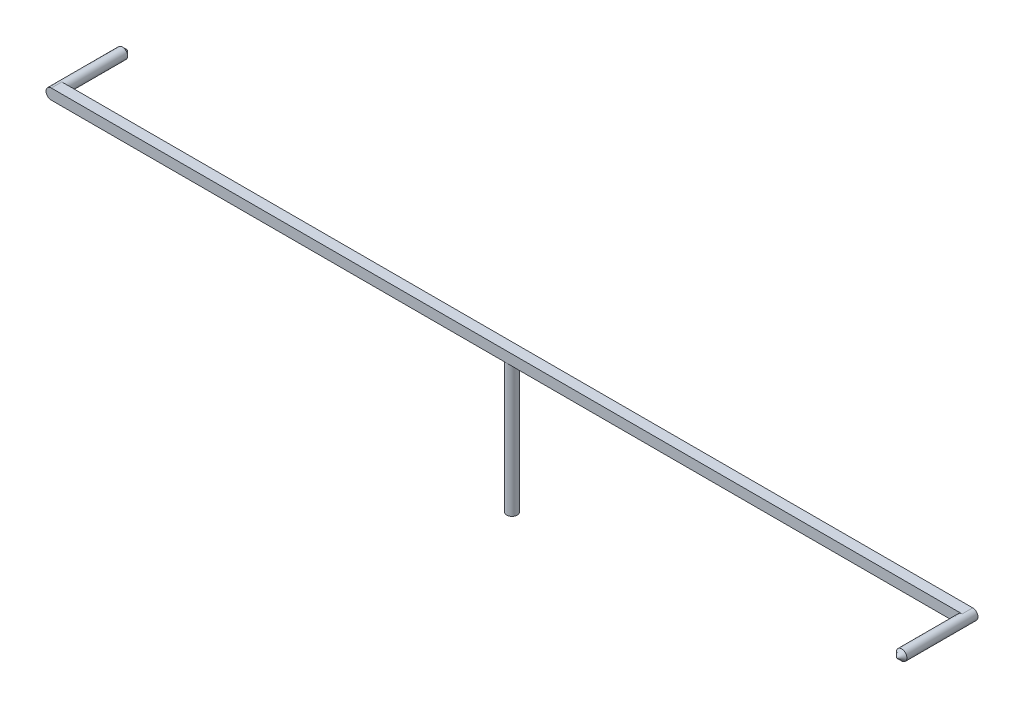
ISO-10303-21;
HEADER;
FILE_DESCRIPTION(('STEP AP214'),'2;1');
FILE_NAME('part.step','',(''),(''),'','','');
FILE_SCHEMA(('AUTOMOTIVE_DESIGN { 1 0 10303 214 1 1 1 1 }'));
ENDSEC;
DATA;
#1=APPLICATION_CONTEXT('core data for automotive mechanical design processes');
#2=APPLICATION_PROTOCOL_DEFINITION('international standard','automotive_design',2000,#1);
#3=PRODUCT_CONTEXT('',#1,'mechanical');
#4=PRODUCT('Part','Part','',(#3));
#5=PRODUCT_RELATED_PRODUCT_CATEGORY('part','',(#4));
#6=PRODUCT_DEFINITION_FORMATION('','',#4);
#7=PRODUCT_DEFINITION_CONTEXT('part definition',#1,'design');
#8=PRODUCT_DEFINITION('design','',#6,#7);
#9=PRODUCT_DEFINITION_SHAPE('','',#8);
#10=(LENGTH_UNIT() NAMED_UNIT(*) SI_UNIT(.MILLI.,.METRE.));
#11=(NAMED_UNIT(*) PLANE_ANGLE_UNIT() SI_UNIT($,.RADIAN.));
#12=(NAMED_UNIT(*) SI_UNIT($,.STERADIAN.) SOLID_ANGLE_UNIT());
#13=UNCERTAINTY_MEASURE_WITH_UNIT(LENGTH_MEASURE(1.E-05),#10,'distance_accuracy_value','');
#14=(GEOMETRIC_REPRESENTATION_CONTEXT(3) GLOBAL_UNCERTAINTY_ASSIGNED_CONTEXT((#13)) GLOBAL_UNIT_ASSIGNED_CONTEXT((#10,
#11,#12)) REPRESENTATION_CONTEXT('',''));
#15=CARTESIAN_POINT('',(0.,0.,0.));
#16=DIRECTION('',(0.,0.,1.));
#17=DIRECTION('',(1.,0.,0.));
#18=AXIS2_PLACEMENT_3D('',#15,#16,#17);
#19=CARTESIAN_POINT('',(0.,10.,0.));
#20=DIRECTION('',(0.,-1.,0.));
#21=DIRECTION('',(0.,0.,-1.));
#22=AXIS2_PLACEMENT_3D('',#19,#20,#21);
#23=CYLINDRICAL_SURFACE('',#22,0.4);
#24=CARTESIAN_POINT('',(0.,10.,0.));
#25=DIRECTION('',(0.,1.,0.));
#26=DIRECTION('',(0.,0.,1.));
#27=AXIS2_PLACEMENT_3D('',#24,#25,#26);
#28=CIRCLE('',#27,0.4);
#29=CARTESIAN_POINT('',(0.,10.,0.4));
#30=VERTEX_POINT('',#29);
#31=CARTESIAN_POINT('',(0.,10.,-0.4));
#32=VERTEX_POINT('',#31);
#33=EDGE_CURVE('E164',#30,#32,#28,.T.);
#34=ORIENTED_EDGE('',*,*,#33,.F.);
#35=EDGE_CURVE('E167',#32,#30,#28,.T.);
#36=ORIENTED_EDGE('',*,*,#35,.F.);
#37=EDGE_LOOP('',(#34,#36));
#38=FACE_BOUND('',#37,.T.);
#39=CARTESIAN_POINT('',(0.,0.,0.));
#40=DIRECTION('',(0.,1.,0.));
#41=DIRECTION('',(0.,0.,1.));
#42=AXIS2_PLACEMENT_3D('',#39,#40,#41);
#43=CIRCLE('',#42,0.4);
#44=CARTESIAN_POINT('',(0.,0.,0.4));
#45=VERTEX_POINT('',#44);
#46=EDGE_CURVE('E153',#45,#45,#43,.T.);
#47=ORIENTED_EDGE('',*,*,#46,.T.);
#48=EDGE_LOOP('',(#47));
#49=FACE_BOUND('',#48,.T.);
#50=ADVANCED_FACE('F35',(#38,#49),#23,.T.);
#51=CARTESIAN_POINT('',(0.,0.,0.));
#52=DIRECTION('',(0.,1.,0.));
#53=DIRECTION('',(0.,0.,1.));
#54=AXIS2_PLACEMENT_3D('',#51,#52,#53);
#55=PLANE('',#54);
#56=ORIENTED_EDGE('',*,*,#46,.F.);
#57=EDGE_LOOP('',(#56));
#58=FACE_BOUND('',#57,.T.);
#59=ADVANCED_FACE('F77',(#58),#55,.F.);
#60=CARTESIAN_POINT('',(0.,10.,0.));
#61=DIRECTION('',(0.,1.,0.));
#62=DIRECTION('',(0.,0.,1.));
#63=AXIS2_PLACEMENT_3D('',#60,#61,#62);
#64=PLANE('',#63);
#65=DIRECTION('',(-1.,0.,0.));
#66=VECTOR('',#65,1.);
#67=CARTESIAN_POINT('',(-35.,10.,-0.4));
#68=LINE('',#67,#66);
#69=CARTESIAN_POINT('',(34.6,10.,-0.4));
#70=VERTEX_POINT('',#69);
#71=EDGE_CURVE('E151',#70,#32,#68,.T.);
#72=ORIENTED_EDGE('',*,*,#71,.F.);
#73=DIRECTION('',(0.,0.,-1.));
#74=VECTOR('',#73,1.);
#75=CARTESIAN_POINT('',(34.6,10.,0.));
#76=LINE('',#75,#74);
#77=CARTESIAN_POINT('',(34.6,10.,0.4));
#78=VERTEX_POINT('',#77);
#79=EDGE_CURVE('E119',#70,#78,#76,.F.);
#80=ORIENTED_EDGE('',*,*,#79,.T.);
#81=DIRECTION('',(1.,0.,0.));
#82=VECTOR('',#81,1.);
#83=CARTESIAN_POINT('',(-35.,10.,0.4));
#84=LINE('',#83,#82);
#85=EDGE_CURVE('E128',#30,#78,#84,.T.);
#86=ORIENTED_EDGE('',*,*,#85,.F.);
#87=ORIENTED_EDGE('',*,*,#33,.T.);
#88=EDGE_LOOP('',(#72,#80,#86,#87));
#89=FACE_BOUND('',#88,.T.);
#90=ADVANCED_FACE('F83',(#89),#64,.F.);
#91=CARTESIAN_POINT('',(-34.6,10.,0.4));
#92=VERTEX_POINT('',#91);
#93=EDGE_CURVE('E161',#92,#30,#84,.T.);
#94=ORIENTED_EDGE('',*,*,#93,.F.);
#95=DIRECTION('',(0.,0.,1.));
#96=VECTOR('',#95,1.);
#97=CARTESIAN_POINT('',(-34.6,10.,0.));
#98=LINE('',#97,#96);
#99=CARTESIAN_POINT('',(-34.6,10.,-0.4));
#100=VERTEX_POINT('',#99);
#101=EDGE_CURVE('E173',#92,#100,#98,.F.);
#102=ORIENTED_EDGE('',*,*,#101,.T.);
#103=EDGE_CURVE('E156',#32,#100,#68,.T.);
#104=ORIENTED_EDGE('',*,*,#103,.F.);
#105=ORIENTED_EDGE('',*,*,#35,.T.);
#106=EDGE_LOOP('',(#94,#102,#104,#105));
#107=FACE_BOUND('',#106,.T.);
#108=ADVANCED_FACE('F179',(#107),#64,.F.);
#109=CARTESIAN_POINT('',(-35.,10.8,0.4));
#110=DIRECTION('',(0.,0.,-1.));
#111=DIRECTION('',(-1.,0.,0.));
#112=AXIS2_PLACEMENT_3D('',#109,#110,#111);
#113=PLANE('',#112);
#114=CARTESIAN_POINT('',(34.6,10.4,0.4));
#115=DIRECTION('',(0.,0.,1.));
#116=DIRECTION('',(1.,0.,0.));
#117=AXIS2_PLACEMENT_3D('',#114,#115,#116);
#118=CIRCLE('',#117,0.399999999999998);
#119=CARTESIAN_POINT('',(34.6,10.8,0.4));
#120=VERTEX_POINT('',#119);
#121=EDGE_CURVE('E108',#120,#78,#118,.T.);
#122=ORIENTED_EDGE('',*,*,#121,.F.);
#123=DIRECTION('',(1.,0.,0.));
#124=VECTOR('',#123,1.);
#125=CARTESIAN_POINT('',(-35.,10.8,0.4));
#126=LINE('',#125,#124);
#127=CARTESIAN_POINT('',(-34.6,10.8,0.4));
#128=VERTEX_POINT('',#127);
#129=EDGE_CURVE('E144',#128,#120,#126,.T.);
#130=ORIENTED_EDGE('',*,*,#129,.F.);
#131=CARTESIAN_POINT('',(-34.6,10.4,0.4));
#132=DIRECTION('',(0.,0.,-1.));
#133=DIRECTION('',(-1.,0.,0.));
#134=AXIS2_PLACEMENT_3D('',#131,#132,#133);
#135=CIRCLE('',#134,0.4);
#136=CARTESIAN_POINT('',(-35.,10.4,0.4));
#137=VERTEX_POINT('',#136);
#138=EDGE_CURVE('E142',#128,#137,#135,.F.);
#139=ORIENTED_EDGE('',*,*,#138,.T.);
#140=CARTESIAN_POINT('',(-34.6,10.4,0.4));
#141=DIRECTION('',(0.,0.,-1.));
#142=DIRECTION('',(-1.,0.,0.));
#143=AXIS2_PLACEMENT_3D('',#140,#141,#142);
#144=CIRCLE('',#143,0.4);
#145=EDGE_CURVE('E171',#137,#92,#144,.F.);
#146=ORIENTED_EDGE('',*,*,#145,.T.);
#147=ORIENTED_EDGE('',*,*,#93,.T.);
#148=ORIENTED_EDGE('',*,*,#85,.T.);
#149=EDGE_LOOP('',(#122,#130,#139,#146,#147,#148));
#150=FACE_BOUND('',#149,.T.);
#151=ADVANCED_FACE('F148',(#150),#113,.F.);
#152=CARTESIAN_POINT('',(-35.,10.8,-0.4));
#153=DIRECTION('',(0.,0.,1.));
#154=DIRECTION('',(1.,0.,0.));
#155=AXIS2_PLACEMENT_3D('',#152,#153,#154);
#156=PLANE('',#155);
#157=CARTESIAN_POINT('',(-34.6,10.4,-0.4));
#158=DIRECTION('',(0.,0.,-1.));
#159=DIRECTION('',(-1.,0.,0.));
#160=AXIS2_PLACEMENT_3D('',#157,#158,#159);
#161=CIRCLE('',#160,0.399999999999998);
#162=CARTESIAN_POINT('',(-34.6,10.8,-0.4));
#163=VERTEX_POINT('',#162);
#164=EDGE_CURVE('E139',#163,#100,#161,.T.);
#165=ORIENTED_EDGE('',*,*,#164,.F.);
#166=DIRECTION('',(-1.,0.,0.));
#167=VECTOR('',#166,1.);
#168=CARTESIAN_POINT('',(-35.,10.8,-0.4));
#169=LINE('',#168,#167);
#170=CARTESIAN_POINT('',(34.6,10.8,-0.4));
#171=VERTEX_POINT('',#170);
#172=EDGE_CURVE('E145',#171,#163,#169,.T.);
#173=ORIENTED_EDGE('',*,*,#172,.F.);
#174=CARTESIAN_POINT('',(34.6,10.4,-0.4));
#175=DIRECTION('',(0.,0.,1.));
#176=DIRECTION('',(1.,0.,0.));
#177=AXIS2_PLACEMENT_3D('',#174,#175,#176);
#178=CIRCLE('',#177,0.4);
#179=CARTESIAN_POINT('',(35.,10.4,-0.4));
#180=VERTEX_POINT('',#179);
#181=EDGE_CURVE('E52',#171,#180,#178,.F.);
#182=ORIENTED_EDGE('',*,*,#181,.T.);
#183=CARTESIAN_POINT('',(34.6,10.4,-0.4));
#184=DIRECTION('',(0.,0.,1.));
#185=DIRECTION('',(1.,0.,0.));
#186=AXIS2_PLACEMENT_3D('',#183,#184,#185);
#187=CIRCLE('',#186,0.4);
#188=EDGE_CURVE('E116',#180,#70,#187,.F.);
#189=ORIENTED_EDGE('',*,*,#188,.T.);
#190=ORIENTED_EDGE('',*,*,#71,.T.);
#191=ORIENTED_EDGE('',*,*,#103,.T.);
#192=EDGE_LOOP('',(#165,#173,#182,#189,#190,#191));
#193=FACE_BOUND('',#192,.T.);
#194=ADVANCED_FACE('F186',(#193),#156,.F.);
#195=CARTESIAN_POINT('',(0.,10.8,0.));
#196=DIRECTION('',(0.,1.,0.));
#197=DIRECTION('',(0.,0.,1.));
#198=AXIS2_PLACEMENT_3D('',#195,#196,#197);
#199=PLANE('',#198);
#200=ORIENTED_EDGE('',*,*,#172,.T.);
#201=DIRECTION('',(0.,0.,1.));
#202=VECTOR('',#201,1.);
#203=CARTESIAN_POINT('',(-34.6,10.8,0.4));
#204=LINE('',#203,#202);
#205=EDGE_CURVE('E115',#163,#128,#204,.T.);
#206=ORIENTED_EDGE('',*,*,#205,.T.);
#207=ORIENTED_EDGE('',*,*,#129,.T.);
#208=DIRECTION('',(0.,0.,-1.));
#209=VECTOR('',#208,1.);
#210=CARTESIAN_POINT('',(34.6,10.8,-0.4));
#211=LINE('',#210,#209);
#212=EDGE_CURVE('E104',#120,#171,#211,.T.);
#213=ORIENTED_EDGE('',*,*,#212,.T.);
#214=EDGE_LOOP('',(#200,#206,#207,#213));
#215=FACE_BOUND('',#214,.T.);
#216=ADVANCED_FACE('F93',(#215),#199,.T.);
#217=CARTESIAN_POINT('',(-34.6,10.4,0.));
#218=DIRECTION('',(0.,0.,-1.));
#219=DIRECTION('',(-1.,0.,0.));
#220=AXIS2_PLACEMENT_3D('',#217,#218,#219);
#221=CYLINDRICAL_SURFACE('',#220,0.4);
#222=CARTESIAN_POINT('',(-34.6,10.4,-5.00000000000001));
#223=DIRECTION('',(0.,0.,-1.));
#224=DIRECTION('',(-1.,0.,0.));
#225=AXIS2_PLACEMENT_3D('',#222,#223,#224);
#226=CIRCLE('',#225,0.4);
#227=CARTESIAN_POINT('',(-35.,10.4,-5.00000000000001));
#228=VERTEX_POINT('',#227);
#229=EDGE_CURVE('E44',#228,#228,#226,.F.);
#230=ORIENTED_EDGE('',*,*,#229,.T.);
#231=EDGE_LOOP('',(#230));
#232=FACE_BOUND('',#231,.T.);
#233=ORIENTED_EDGE('',*,*,#205,.F.);
#234=ORIENTED_EDGE('',*,*,#164,.T.);
#235=ORIENTED_EDGE('',*,*,#101,.F.);
#236=ORIENTED_EDGE('',*,*,#145,.F.);
#237=DIRECTION('',(0.,0.,1.));
#238=VECTOR('',#237,1.);
#239=CARTESIAN_POINT('',(-35.,10.4,-0.4));
#240=LINE('',#239,#238);
#241=CARTESIAN_POINT('',(-35.,10.4,-0.4));
#242=VERTEX_POINT('',#241);
#243=EDGE_CURVE('E126',#137,#242,#240,.F.);
#244=ORIENTED_EDGE('',*,*,#243,.T.);
#245=ORIENTED_EDGE('',*,*,#243,.F.);
#246=ORIENTED_EDGE('',*,*,#138,.F.);
#247=EDGE_LOOP('',(#233,#234,#235,#236,#244,#245,#246));
#248=FACE_BOUND('',#247,.T.);
#249=ADVANCED_FACE('F90',(#232,#248),#221,.T.);
#250=CARTESIAN_POINT('',(34.6,10.4,0.));
#251=DIRECTION('',(0.,0.,1.));
#252=DIRECTION('',(1.,0.,0.));
#253=AXIS2_PLACEMENT_3D('',#250,#251,#252);
#254=CYLINDRICAL_SURFACE('',#253,0.4);
#255=CARTESIAN_POINT('',(34.6,10.4,5.00000000000001));
#256=DIRECTION('',(0.,0.,1.));
#257=DIRECTION('',(1.,0.,0.));
#258=AXIS2_PLACEMENT_3D('',#255,#256,#257);
#259=CIRCLE('',#258,0.4);
#260=CARTESIAN_POINT('',(35.,10.4,5.00000000000001));
#261=VERTEX_POINT('',#260);
#262=EDGE_CURVE('E11',#261,#261,#259,.F.);
#263=ORIENTED_EDGE('',*,*,#262,.T.);
#264=EDGE_LOOP('',(#263));
#265=FACE_BOUND('',#264,.T.);
#266=ORIENTED_EDGE('',*,*,#212,.F.);
#267=ORIENTED_EDGE('',*,*,#121,.T.);
#268=ORIENTED_EDGE('',*,*,#79,.F.);
#269=ORIENTED_EDGE('',*,*,#188,.F.);
#270=DIRECTION('',(0.,0.,-1.));
#271=VECTOR('',#270,1.);
#272=CARTESIAN_POINT('',(35.,10.4,0.4));
#273=LINE('',#272,#271);
#274=CARTESIAN_POINT('',(35.,10.4,0.4));
#275=VERTEX_POINT('',#274);
#276=EDGE_CURVE('E129',#180,#275,#273,.F.);
#277=ORIENTED_EDGE('',*,*,#276,.T.);
#278=ORIENTED_EDGE('',*,*,#276,.F.);
#279=ORIENTED_EDGE('',*,*,#181,.F.);
#280=EDGE_LOOP('',(#266,#267,#268,#269,#277,#278,#279));
#281=FACE_BOUND('',#280,.T.);
#282=ADVANCED_FACE('F73',(#265,#281),#254,.T.);
#283=CARTESIAN_POINT('',(-34.6,10.4,-5.00000000000001));
#284=DIRECTION('',(0.,0.,1.));
#285=DIRECTION('',(1.,0.,0.));
#286=AXIS2_PLACEMENT_3D('',#283,#284,#285);
#287=CONICAL_SURFACE('',#286,0.399999999999984,0.785398163397439);
#288=ORIENTED_EDGE('',*,*,#229,.F.);
#289=EDGE_LOOP('',(#288));
#290=FACE_BOUND('',#289,.T.);
#291=CARTESIAN_POINT('',(-34.6,10.4,-5.4));
#292=VERTEX_POINT('',#291);
#293=VERTEX_LOOP('',#292);
#294=FACE_BOUND('',#293,.T.);
#295=ADVANCED_FACE('F68',(#290,#294),#287,.T.);
#296=CARTESIAN_POINT('',(34.6,10.4,5.00000000000001));
#297=DIRECTION('',(0.,0.,-1.));
#298=DIRECTION('',(-1.,0.,0.));
#299=AXIS2_PLACEMENT_3D('',#296,#297,#298);
#300=CONICAL_SURFACE('',#299,0.399999999999984,0.785398163397439);
#301=ORIENTED_EDGE('',*,*,#262,.F.);
#302=EDGE_LOOP('',(#301));
#303=FACE_BOUND('',#302,.T.);
#304=CARTESIAN_POINT('',(34.6,10.4,5.4));
#305=VERTEX_POINT('',#304);
#306=VERTEX_LOOP('',#305);
#307=FACE_BOUND('',#306,.T.);
#308=ADVANCED_FACE('F37',(#303,#307),#300,.T.);
#309=CLOSED_SHELL('',(#50,#59,#90,#108,#151,#194,#216,#249,#282,#295,#308));
#310=MANIFOLD_SOLID_BREP('B2',#309);
#311=ADVANCED_BREP_SHAPE_REPRESENTATION('',(#18,#310),#14);
#312=SHAPE_DEFINITION_REPRESENTATION(#9,#311);
ENDSEC;
END-ISO-10303-21;
